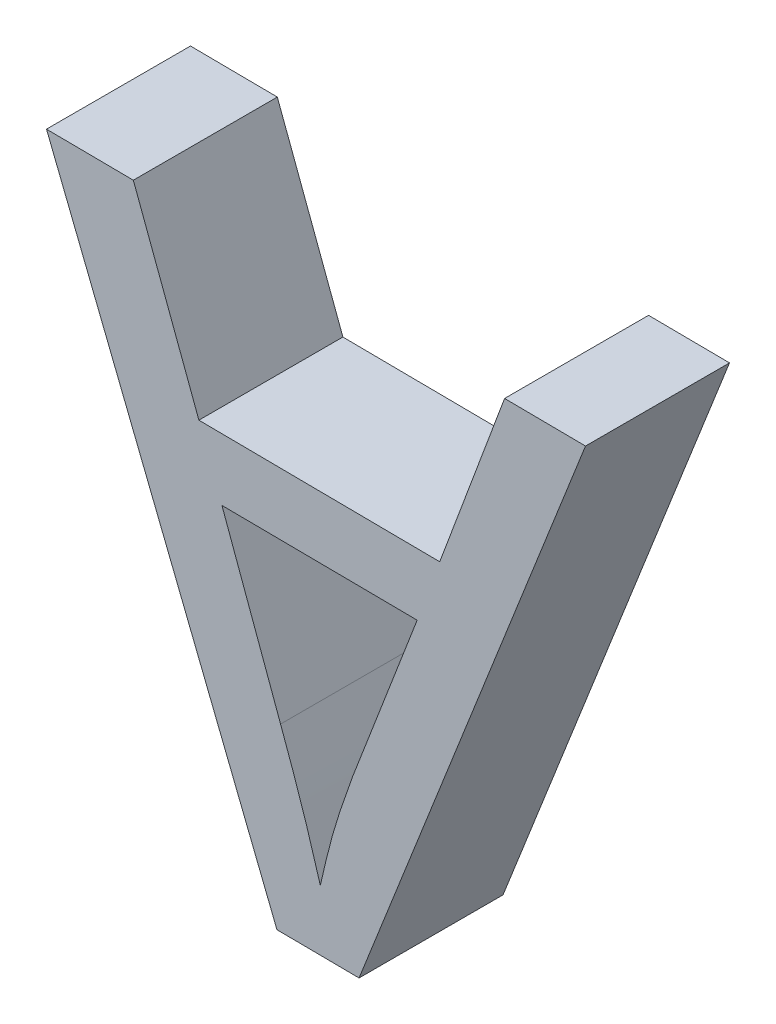
ISO-10303-21;
HEADER;
FILE_DESCRIPTION(('STEP AP214'),'2;1');
FILE_NAME('part.step','',(''),(''),'','','');
FILE_SCHEMA(('AUTOMOTIVE_DESIGN { 1 0 10303 214 1 1 1 1 }'));
ENDSEC;
DATA;
#1=APPLICATION_CONTEXT('core data for automotive mechanical design processes');
#2=APPLICATION_PROTOCOL_DEFINITION('international standard','automotive_design',2000,#1);
#3=PRODUCT_CONTEXT('',#1,'mechanical');
#4=PRODUCT('Part','Part','',(#3));
#5=PRODUCT_RELATED_PRODUCT_CATEGORY('part','',(#4));
#6=PRODUCT_DEFINITION_FORMATION('','',#4);
#7=PRODUCT_DEFINITION_CONTEXT('part definition',#1,'design');
#8=PRODUCT_DEFINITION('design','',#6,#7);
#9=PRODUCT_DEFINITION_SHAPE('','',#8);
#10=(LENGTH_UNIT() NAMED_UNIT(*) SI_UNIT(.MILLI.,.METRE.));
#11=(NAMED_UNIT(*) PLANE_ANGLE_UNIT() SI_UNIT($,.RADIAN.));
#12=(NAMED_UNIT(*) SI_UNIT($,.STERADIAN.) SOLID_ANGLE_UNIT());
#13=UNCERTAINTY_MEASURE_WITH_UNIT(LENGTH_MEASURE(1.E-05),#10,'distance_accuracy_value','');
#14=(GEOMETRIC_REPRESENTATION_CONTEXT(3) GLOBAL_UNCERTAINTY_ASSIGNED_CONTEXT((#13)) GLOBAL_UNIT_ASSIGNED_CONTEXT((#10,
#11,#12)) REPRESENTATION_CONTEXT('',''));
#15=CARTESIAN_POINT('',(0.,0.,0.));
#16=DIRECTION('',(0.,0.,1.));
#17=DIRECTION('',(1.,0.,0.));
#18=AXIS2_PLACEMENT_3D('',#15,#16,#17);
#19=CARTESIAN_POINT('',(-0.0146779465040658,8.14016208901112,0.));
#20=DIRECTION('',(0.936428455395928,0.350858586790743,0.));
#21=DIRECTION('',(0.,0.,-1.));
#22=AXIS2_PLACEMENT_3D('',#19,#20,#21);
#23=PLANE('',#22);
#24=DIRECTION('',(0.350858586790743,-0.936428455395928,0.));
#25=VECTOR('',#24,1.);
#26=CARTESIAN_POINT('',(-0.128549236752959,8.44408030693779,0.));
#27=LINE('',#26,#25);
#28=CARTESIAN_POINT('',(-0.128549236752959,8.44408030693779,0.));
#29=VERTEX_POINT('',#28);
#30=CARTESIAN_POINT('',(-0.0146779465040658,8.14016208901112,0.));
#31=VERTEX_POINT('',#30);
#32=EDGE_CURVE('E216',#29,#31,#27,.T.);
#33=ORIENTED_EDGE('',*,*,#32,.F.);
#34=DIRECTION('',(0.,0.,1.));
#35=VECTOR('',#34,1.);
#36=CARTESIAN_POINT('',(-0.128549236752959,8.44408030693779,0.));
#37=LINE('',#36,#35);
#38=CARTESIAN_POINT('',(-0.128549236752959,8.44408030693779,0.25));
#39=VERTEX_POINT('',#38);
#40=EDGE_CURVE('E277',#29,#39,#37,.T.);
#41=ORIENTED_EDGE('',*,*,#40,.T.);
#42=DIRECTION('',(-0.350858586790743,0.936428455395928,0.));
#43=VECTOR('',#42,1.);
#44=CARTESIAN_POINT('',(-0.128549236752959,8.44408030693779,0.25));
#45=LINE('',#44,#43);
#46=CARTESIAN_POINT('',(-0.0146779465040658,8.14016208901112,0.25));
#47=VERTEX_POINT('',#46);
#48=EDGE_CURVE('E232',#47,#39,#45,.T.);
#49=ORIENTED_EDGE('',*,*,#48,.F.);
#50=DIRECTION('',(0.,0.,1.));
#51=VECTOR('',#50,1.);
#52=CARTESIAN_POINT('',(-0.0146779465040658,8.14016208901112,0.));
#53=LINE('',#52,#51);
#54=EDGE_CURVE('E11',#31,#47,#53,.T.);
#55=ORIENTED_EDGE('',*,*,#54,.F.);
#56=EDGE_LOOP('',(#33,#41,#49,#55));
#57=FACE_BOUND('',#56,.T.);
#58=ADVANCED_FACE('F16',(#57),#23,.T.);
#59=CARTESIAN_POINT('',(0.403449057373279,8.13634085694236,0.));
#60=DIRECTION('',(0.00913854515184213,0.999958242624415,0.));
#61=DIRECTION('',(0.,0.,-1.));
#62=AXIS2_PLACEMENT_3D('',#59,#60,#61);
#63=PLANE('',#62);
#64=DIRECTION('',(0.999958242624415,-0.00913854515184213,0.));
#65=VECTOR('',#64,1.);
#66=CARTESIAN_POINT('',(-0.0146779465040658,8.14016208901112,0.));
#67=LINE('',#66,#65);
#68=CARTESIAN_POINT('',(0.403449057373279,8.13634085694236,0.));
#69=VERTEX_POINT('',#68);
#70=EDGE_CURVE('E219',#31,#69,#67,.T.);
#71=ORIENTED_EDGE('',*,*,#70,.F.);
#72=ORIENTED_EDGE('',*,*,#54,.T.);
#73=DIRECTION('',(-0.999958242624415,0.00913854515184213,0.));
#74=VECTOR('',#73,1.);
#75=CARTESIAN_POINT('',(-0.0146779465040658,8.14016208901112,0.25));
#76=LINE('',#75,#74);
#77=CARTESIAN_POINT('',(0.403449057373279,8.13634085694236,0.25));
#78=VERTEX_POINT('',#77);
#79=EDGE_CURVE('E224',#78,#47,#76,.T.);
#80=ORIENTED_EDGE('',*,*,#79,.F.);
#81=DIRECTION('',(0.,0.,1.));
#82=VECTOR('',#81,1.);
#83=CARTESIAN_POINT('',(0.403449057373279,8.13634085694236,0.));
#84=LINE('',#83,#82);
#85=EDGE_CURVE('E27',#69,#78,#84,.T.);
#86=ORIENTED_EDGE('',*,*,#85,.F.);
#87=EDGE_LOOP('',(#71,#72,#80,#86));
#88=FACE_BOUND('',#87,.T.);
#89=ADVANCED_FACE('F661',(#88),#63,.T.);
#90=CARTESIAN_POINT('',(0.12082792661046,7.44175949328272,0.));
#91=DIRECTION('',(-0.00913854515183979,-0.999958242624415,0.));
#92=DIRECTION('',(-0.999958242624415,0.00913854515183979,0.));
#93=AXIS2_PLACEMENT_3D('',#90,#91,#92);
#94=PLANE('',#93);
#95=DIRECTION('',(-0.999958242624415,0.00913854515183979,0.));
#96=VECTOR('',#95,1.);
#97=CARTESIAN_POINT('',(0.263386747039235,7.44045665866249,0.));
#98=LINE('',#97,#96);
#99=CARTESIAN_POINT('',(0.263386747039235,7.44045665866249,0.));
#100=VERTEX_POINT('',#99);
#101=CARTESIAN_POINT('',(0.12082792661046,7.44175949328272,0.));
#102=VERTEX_POINT('',#101);
#103=EDGE_CURVE('E243',#100,#102,#98,.T.);
#104=ORIENTED_EDGE('',*,*,#103,.F.);
#105=DIRECTION('',(0.,0.,1.));
#106=VECTOR('',#105,1.);
#107=CARTESIAN_POINT('',(0.263386747039235,7.44045665866249,0.));
#108=LINE('',#107,#106);
#109=CARTESIAN_POINT('',(0.263386747039235,7.44045665866249,0.25));
#110=VERTEX_POINT('',#109);
#111=EDGE_CURVE('E20',#100,#110,#108,.T.);
#112=ORIENTED_EDGE('',*,*,#111,.T.);
#113=DIRECTION('',(0.999958242624415,-0.00913854515183979,0.));
#114=VECTOR('',#113,1.);
#115=CARTESIAN_POINT('',(0.263386747039235,7.44045665866249,0.25));
#116=LINE('',#115,#114);
#117=CARTESIAN_POINT('',(0.12082792661046,7.44175949328272,0.25));
#118=VERTEX_POINT('',#117);
#119=EDGE_CURVE('E207',#118,#110,#116,.T.);
#120=ORIENTED_EDGE('',*,*,#119,.F.);
#121=DIRECTION('',(0.,0.,1.));
#122=VECTOR('',#121,1.);
#123=CARTESIAN_POINT('',(0.12082792661046,7.44175949328272,0.));
#124=LINE('',#123,#122);
#125=EDGE_CURVE('E306',#102,#118,#124,.T.);
#126=ORIENTED_EDGE('',*,*,#125,.F.);
#127=EDGE_LOOP('',(#104,#112,#120,#126));
#128=FACE_BOUND('',#127,.T.);
#129=ADVANCED_FACE('F343',(#128),#94,.T.);
#130=CARTESIAN_POINT('',(0.516034966202386,8.43818949911025,0.));
#131=DIRECTION('',(-0.936947503181286,0.349470136467129,0.));
#132=DIRECTION('',(0.,0.,1.));
#133=AXIS2_PLACEMENT_3D('',#130,#131,#132);
#134=PLANE('',#133);
#135=DIRECTION('',(0.349470136467129,0.936947503181286,0.));
#136=VECTOR('',#135,1.);
#137=CARTESIAN_POINT('',(0.403449057373279,8.13634085694236,0.));
#138=LINE('',#137,#136);
#139=CARTESIAN_POINT('',(0.516034966202386,8.43818949911025,0.));
#140=VERTEX_POINT('',#139);
#141=EDGE_CURVE('E251',#69,#140,#138,.T.);
#142=ORIENTED_EDGE('',*,*,#141,.F.);
#143=ORIENTED_EDGE('',*,*,#85,.T.);
#144=DIRECTION('',(-0.349470136467129,-0.936947503181286,0.));
#145=VECTOR('',#144,1.);
#146=CARTESIAN_POINT('',(0.403449057373279,8.13634085694236,0.25));
#147=LINE('',#146,#145);
#148=CARTESIAN_POINT('',(0.516034966202386,8.43818949911025,0.25));
#149=VERTEX_POINT('',#148);
#150=EDGE_CURVE('E221',#149,#78,#147,.T.);
#151=ORIENTED_EDGE('',*,*,#150,.F.);
#152=DIRECTION('',(0.,0.,1.));
#153=VECTOR('',#152,1.);
#154=CARTESIAN_POINT('',(0.516034966202386,8.43818949911025,0.));
#155=LINE('',#154,#153);
#156=EDGE_CURVE('E136',#140,#149,#155,.T.);
#157=ORIENTED_EDGE('',*,*,#156,.F.);
#158=EDGE_LOOP('',(#142,#143,#151,#157));
#159=FACE_BOUND('',#158,.T.);
#160=ADVANCED_FACE('F660',(#159),#134,.T.);
#161=CARTESIAN_POINT('',(0.0252629552289445,8.03201627227275,0.));
#162=DIRECTION('',(-0.00913854515184274,-0.999958242624415,0.));
#163=DIRECTION('',(-0.999958242624415,0.00913854515184274,0.));
#164=AXIS2_PLACEMENT_3D('',#161,#162,#163);
#165=PLANE('',#164);
#166=DIRECTION('',(-0.999958242624415,0.00913854515184274,0.));
#167=VECTOR('',#166,1.);
#168=CARTESIAN_POINT('',(0.364266607172335,8.02891814272306,0.));
#169=LINE('',#168,#167);
#170=CARTESIAN_POINT('',(0.364266607172335,8.02891814272306,0.));
#171=VERTEX_POINT('',#170);
#172=CARTESIAN_POINT('',(0.0252629552289445,8.03201627227275,0.));
#173=VERTEX_POINT('',#172);
#174=EDGE_CURVE('E247',#171,#173,#169,.T.);
#175=ORIENTED_EDGE('',*,*,#174,.F.);
#176=DIRECTION('',(0.,0.,1.));
#177=VECTOR('',#176,1.);
#178=CARTESIAN_POINT('',(0.364266607172335,8.02891814272306,0.));
#179=LINE('',#178,#177);
#180=CARTESIAN_POINT('',(0.364266607172335,8.02891814272306,0.25));
#181=VERTEX_POINT('',#180);
#182=EDGE_CURVE('E59',#171,#181,#179,.T.);
#183=ORIENTED_EDGE('',*,*,#182,.T.);
#184=DIRECTION('',(0.999958242624415,-0.00913854515184274,0.));
#185=VECTOR('',#184,1.);
#186=CARTESIAN_POINT('',(0.364266607172335,8.02891814272306,0.25));
#187=LINE('',#186,#185);
#188=CARTESIAN_POINT('',(0.0252629552289445,8.03201627227275,0.25));
#189=VERTEX_POINT('',#188);
#190=EDGE_CURVE('E177',#189,#181,#187,.T.);
#191=ORIENTED_EDGE('',*,*,#190,.F.);
#192=DIRECTION('',(0.,0.,1.));
#193=VECTOR('',#192,1.);
#194=CARTESIAN_POINT('',(0.0252629552289445,8.03201627227275,0.));
#195=LINE('',#194,#193);
#196=EDGE_CURVE('E172',#173,#189,#195,.T.);
#197=ORIENTED_EDGE('',*,*,#196,.F.);
#198=EDGE_LOOP('',(#175,#183,#191,#197));
#199=FACE_BOUND('',#198,.T.);
#200=ADVANCED_FACE('F328',(#199),#165,.T.);
#201=CARTESIAN_POINT('',(0.127093378407057,7.75413004530102,0.));
#202=DIRECTION('',(0.938943127184931,0.344072381792236,0.));
#203=DIRECTION('',(0.,0.,-1.));
#204=AXIS2_PLACEMENT_3D('',#201,#202,#203);
#205=PLANE('',#204);
#206=DIRECTION('',(0.344072381792236,-0.938943127184931,0.));
#207=VECTOR('',#206,1.);
#208=CARTESIAN_POINT('',(0.0252629552289446,8.03201627227275,0.));
#209=LINE('',#208,#207);
#210=CARTESIAN_POINT('',(0.127093378407057,7.75413004530102,0.));
#211=VERTEX_POINT('',#210);
#212=EDGE_CURVE('E206',#173,#211,#209,.T.);
#213=ORIENTED_EDGE('',*,*,#212,.F.);
#214=ORIENTED_EDGE('',*,*,#196,.T.);
#215=DIRECTION('',(-0.344072381792236,0.938943127184931,0.));
#216=VECTOR('',#215,1.);
#217=CARTESIAN_POINT('',(0.0252629552289446,8.03201627227275,0.25));
#218=LINE('',#217,#216);
#219=CARTESIAN_POINT('',(0.127093378407057,7.75413004530102,0.25));
#220=VERTEX_POINT('',#219);
#221=EDGE_CURVE('E170',#220,#189,#218,.T.);
#222=ORIENTED_EDGE('',*,*,#221,.F.);
#223=DIRECTION('',(0.,0.,1.));
#224=VECTOR('',#223,1.);
#225=CARTESIAN_POINT('',(0.127093378407057,7.75413004530102,0.));
#226=LINE('',#225,#224);
#227=EDGE_CURVE('E156',#211,#220,#226,.T.);
#228=ORIENTED_EDGE('',*,*,#227,.F.);
#229=EDGE_LOOP('',(#213,#214,#222,#228));
#230=FACE_BOUND('',#229,.T.);
#231=ADVANCED_FACE('F171',(#230),#205,.T.);
#232=CARTESIAN_POINT('',(0.263386747039235,7.44045665866249,0.));
#233=DIRECTION('',(0.930210818145052,-0.367025658239192,0.));
#234=DIRECTION('',(0.,0.,-1.));
#235=AXIS2_PLACEMENT_3D('',#232,#233,#234);
#236=PLANE('',#235);
#237=DIRECTION('',(-0.367025658239192,-0.930210818145052,0.));
#238=VECTOR('',#237,1.);
#239=CARTESIAN_POINT('',(0.656547346610332,8.4369053667555,0.));
#240=LINE('',#239,#238);
#241=CARTESIAN_POINT('',(0.656547346610332,8.4369053667555,0.));
#242=VERTEX_POINT('',#241);
#243=EDGE_CURVE('E240',#242,#100,#240,.T.);
#244=ORIENTED_EDGE('',*,*,#243,.F.);
#245=DIRECTION('',(0.,0.,1.));
#246=VECTOR('',#245,1.);
#247=CARTESIAN_POINT('',(0.656547346610332,8.4369053667555,0.));
#248=LINE('',#247,#246);
#249=CARTESIAN_POINT('',(0.656547346610332,8.4369053667555,0.25));
#250=VERTEX_POINT('',#249);
#251=EDGE_CURVE('E244',#242,#250,#248,.T.);
#252=ORIENTED_EDGE('',*,*,#251,.T.);
#253=DIRECTION('',(0.367025658239192,0.930210818145052,0.));
#254=VECTOR('',#253,1.);
#255=CARTESIAN_POINT('',(0.656547346610332,8.4369053667555,0.25));
#256=LINE('',#255,#254);
#257=EDGE_CURVE('E214',#110,#250,#256,.T.);
#258=ORIENTED_EDGE('',*,*,#257,.F.);
#259=ORIENTED_EDGE('',*,*,#111,.F.);
#260=EDGE_LOOP('',(#244,#252,#258,#259));
#261=FACE_BOUND('',#260,.T.);
#262=ADVANCED_FACE('F336',(#261),#236,.T.);
#263=CARTESIAN_POINT('',(-0.279293519254275,8.44545794789649,0.));
#264=DIRECTION('',(-0.928909421372805,-0.370307017061303,0.));
#265=DIRECTION('',(-0.370307017061303,0.928909421372805,0.));
#266=AXIS2_PLACEMENT_3D('',#263,#264,#265);
#267=PLANE('',#266);
#268=DIRECTION('',(-0.370307017061303,0.928909421372805,0.));
#269=VECTOR('',#268,1.);
#270=CARTESIAN_POINT('',(0.120827926610459,7.44175949328272,0.));
#271=LINE('',#270,#269);
#272=CARTESIAN_POINT('',(-0.279293519254275,8.44545794789649,0.));
#273=VERTEX_POINT('',#272);
#274=EDGE_CURVE('E267',#102,#273,#271,.T.);
#275=ORIENTED_EDGE('',*,*,#274,.F.);
#276=ORIENTED_EDGE('',*,*,#125,.T.);
#277=DIRECTION('',(0.370307017061303,-0.928909421372805,0.));
#278=VECTOR('',#277,1.);
#279=CARTESIAN_POINT('',(0.120827926610459,7.44175949328272,0.25));
#280=LINE('',#279,#278);
#281=CARTESIAN_POINT('',(-0.279293519254275,8.44545794789649,0.25));
#282=VERTEX_POINT('',#281);
#283=EDGE_CURVE('E215',#282,#118,#280,.T.);
#284=ORIENTED_EDGE('',*,*,#283,.F.);
#285=DIRECTION('',(0.,0.,1.));
#286=VECTOR('',#285,1.);
#287=CARTESIAN_POINT('',(-0.279293519254275,8.44545794789649,0.));
#288=LINE('',#287,#286);
#289=EDGE_CURVE('E274',#273,#282,#288,.T.);
#290=ORIENTED_EDGE('',*,*,#289,.F.);
#291=EDGE_LOOP('',(#275,#276,#284,#290));
#292=FACE_BOUND('',#291,.T.);
#293=ADVANCED_FACE('F348',(#292),#267,.T.);
#294=CARTESIAN_POINT('',(-0.128549236752959,8.44408030693779,0.));
#295=DIRECTION('',(0.00913854515184613,0.999958242624415,0.));
#296=DIRECTION('',(0.,0.,-1.));
#297=AXIS2_PLACEMENT_3D('',#294,#295,#296);
#298=PLANE('',#297);
#299=DIRECTION('',(0.999958242624415,-0.00913854515184613,0.));
#300=VECTOR('',#299,1.);
#301=CARTESIAN_POINT('',(-0.279293519254276,8.44545794789649,0.));
#302=LINE('',#301,#300);
#303=EDGE_CURVE('E220',#273,#29,#302,.T.);
#304=ORIENTED_EDGE('',*,*,#303,.F.);
#305=ORIENTED_EDGE('',*,*,#289,.T.);
#306=DIRECTION('',(-0.999958242624415,0.00913854515184613,0.));
#307=VECTOR('',#306,1.);
#308=CARTESIAN_POINT('',(-0.279293519254276,8.44545794789649,0.25));
#309=LINE('',#308,#307);
#310=EDGE_CURVE('E197',#39,#282,#309,.T.);
#311=ORIENTED_EDGE('',*,*,#310,.F.);
#312=ORIENTED_EDGE('',*,*,#40,.F.);
#313=EDGE_LOOP('',(#304,#305,#311,#312));
#314=FACE_BOUND('',#313,.T.);
#315=ADVANCED_FACE('F641',(#314),#298,.T.);
#316=CARTESIAN_POINT('',(0.364266607172335,8.02891814272306,0.));
#317=DIRECTION('',(-0.933264445247148,0.359190026639847,0.));
#318=DIRECTION('',(0.,0.,1.));
#319=AXIS2_PLACEMENT_3D('',#316,#317,#318);
#320=PLANE('',#319);
#321=DIRECTION('',(0.359190026639847,0.933264445247148,0.));
#322=VECTOR('',#321,1.);
#323=CARTESIAN_POINT('',(0.251767969454302,7.73661888346147,0.));
#324=LINE('',#323,#322);
#325=CARTESIAN_POINT('',(0.251767969454302,7.73661888346147,0.));
#326=VERTEX_POINT('',#325);
#327=EDGE_CURVE('E283',#326,#171,#324,.T.);
#328=ORIENTED_EDGE('',*,*,#327,.F.);
#329=DIRECTION('',(0.,0.,1.));
#330=VECTOR('',#329,1.);
#331=CARTESIAN_POINT('',(0.251767969454302,7.73661888346147,0.));
#332=LINE('',#331,#330);
#333=CARTESIAN_POINT('',(0.251767969454302,7.73661888346147,0.25));
#334=VERTEX_POINT('',#333);
#335=EDGE_CURVE('E74',#326,#334,#332,.T.);
#336=ORIENTED_EDGE('',*,*,#335,.T.);
#337=DIRECTION('',(-0.359190026639847,-0.933264445247148,0.));
#338=VECTOR('',#337,1.);
#339=CARTESIAN_POINT('',(0.251767969454302,7.73661888346147,0.25));
#340=LINE('',#339,#338);
#341=EDGE_CURVE('E191',#181,#334,#340,.T.);
#342=ORIENTED_EDGE('',*,*,#341,.F.);
#343=ORIENTED_EDGE('',*,*,#182,.F.);
#344=EDGE_LOOP('',(#328,#336,#342,#343));
#345=FACE_BOUND('',#344,.T.);
#346=ADVANCED_FACE('F325',(#345),#320,.T.);
#347=CARTESIAN_POINT('',(0.196136831434265,7.54612338491067,0.));
#348=CARTESIAN_POINT('',(0.196136831434265,7.54612338491067,0.25));
#349=CARTESIAN_POINT('',(0.186913463851153,7.57711045178989,0.));
#350=CARTESIAN_POINT('',(0.186913463851153,7.57711045178989,0.25));
#351=CARTESIAN_POINT('',(0.166063393095519,7.64715889463027,0.));
#352=CARTESIAN_POINT('',(0.166063393095519,7.64715889463027,0.25));
#353=CARTESIAN_POINT('',(0.141044665391837,7.71583431372302,0.));
#354=CARTESIAN_POINT('',(0.141044665391837,7.71583431372302,0.25));
#355=CARTESIAN_POINT('',(0.127093378407057,7.75413004530102,0.));
#356=CARTESIAN_POINT('',(0.127093378407057,7.75413004530102,0.25));
#357=(BOUNDED_SURFACE() B_SPLINE_SURFACE(3,1,((#347,#348),(#349,#350),(#351,#352),(#353,#354),
(#355,#356)),.UNSPECIFIED.,.F.,.F.,.F.) B_SPLINE_SURFACE_WITH_KNOTS((4,1,4),(2,2),
(-0.0219209434398483,-0.0122238579246973,0.),(0.,0.025),
.UNSPECIFIED.) GEOMETRIC_REPRESENTATION_ITEM() RATIONAL_B_SPLINE_SURFACE(((1.,1.),(1.,1.),(1.,
1.),(1.,1.),(1.,1.))) REPRESENTATION_ITEM('') SURFACE());
#358=CARTESIAN_POINT('',(0.127093378407057,7.75413004530102,0.));
#359=CARTESIAN_POINT('',(0.141044665391837,7.71583431372302,0.));
#360=CARTESIAN_POINT('',(0.166063393095519,7.64715889463027,0.));
#361=CARTESIAN_POINT('',(0.186913463851153,7.57711045178989,0.));
#362=CARTESIAN_POINT('',(0.196136831434265,7.54612338491067,0.));
#363=(BOUNDED_CURVE() B_SPLINE_CURVE(3,(#358,#359,#360,#361,#362),.UNSPECIFIED.,.F.,
.F.) B_SPLINE_CURVE_WITH_KNOTS((4,1,4),(0.,0.0122238579246973,0.0219209434398483),
.UNSPECIFIED.) CURVE() GEOMETRIC_REPRESENTATION_ITEM() RATIONAL_B_SPLINE_CURVE((1.,1.,1.,1.,1.)) REPRESENTATION_ITEM(''));
#364=CARTESIAN_POINT('',(0.196136831434265,7.54612338491067,0.));
#365=VERTEX_POINT('',#364);
#366=EDGE_CURVE('E163',#211,#365,#363,.T.);
#367=CARTESIAN_POINT('',(0.196136831434265,7.54612338491067,0.25));
#368=CARTESIAN_POINT('',(0.186913463851153,7.57711045178989,0.25));
#369=CARTESIAN_POINT('',(0.166063393095519,7.64715889463027,0.25));
#370=CARTESIAN_POINT('',(0.141044665391837,7.71583431372302,0.25));
#371=CARTESIAN_POINT('',(0.127093378407057,7.75413004530102,0.25));
#372=(BOUNDED_CURVE() B_SPLINE_CURVE(3,(#367,#368,#369,#370,#371),.UNSPECIFIED.,.F.,
.F.) B_SPLINE_CURVE_WITH_KNOTS((4,1,4),(-0.0219209434398483,-0.0122238579246973,0.),
.UNSPECIFIED.) CURVE() GEOMETRIC_REPRESENTATION_ITEM() RATIONAL_B_SPLINE_CURVE((1.,1.,1.,1.,1.)) REPRESENTATION_ITEM(''));
#373=CARTESIAN_POINT('',(0.196136831434265,7.54612338491067,0.25));
#374=VERTEX_POINT('',#373);
#375=EDGE_CURVE('E160',#374,#220,#372,.T.);
#376=DIRECTION('',(0.,0.,1.));
#377=VECTOR('',#376,1.);
#378=CARTESIAN_POINT('',(0.196136831434265,7.54612338491067,0.));
#379=LINE('',#378,#377);
#380=EDGE_CURVE('E41',#365,#374,#379,.T.);
#381=ORIENTED_EDGE('',*,*,#366,.F.);
#382=ORIENTED_EDGE('',*,*,#227,.T.);
#383=ORIENTED_EDGE('',*,*,#375,.F.);
#384=ORIENTED_EDGE('',*,*,#380,.F.);
#385=EDGE_LOOP('',(#381,#382,#383,#384));
#386=FACE_BOUND('',#385,.T.);
#387=ADVANCED_FACE('F158',(#386),#357,.T.);
#388=CARTESIAN_POINT('',(0.251767969454302,7.73661888346147,0.));
#389=CARTESIAN_POINT('',(0.251767969454302,7.73661888346147,0.25));
#390=CARTESIAN_POINT('',(0.240561738714224,7.70517848483268,0.));
#391=CARTESIAN_POINT('',(0.240561738714224,7.70517848483268,0.25));
#392=CARTESIAN_POINT('',(0.218314222150515,7.64276045994213,0.));
#393=CARTESIAN_POINT('',(0.218314222150515,7.64276045994213,0.25));
#394=CARTESIAN_POINT('',(0.203492665593489,7.57817613208273,0.));
#395=CARTESIAN_POINT('',(0.203492665593489,7.57817613208273,0.25));
#396=CARTESIAN_POINT('',(0.196136831434265,7.54612338491067,0.));
#397=CARTESIAN_POINT('',(0.196136831434265,7.54612338491067,0.25));
#398=(BOUNDED_SURFACE() B_SPLINE_SURFACE(3,1,((#388,#389),(#390,#391),(#392,#393),(#394,#395),
(#396,#397)),.UNSPECIFIED.,.F.,.F.,.F.) B_SPLINE_SURFACE_WITH_KNOTS((4,1,4),(2,2),
(-0.0198603104071659,-0.00985653221669089,0.),(0.,0.025),
.UNSPECIFIED.) GEOMETRIC_REPRESENTATION_ITEM() RATIONAL_B_SPLINE_SURFACE(((1.,1.),(1.,1.),(1.,
1.),(1.,1.),(1.,1.))) REPRESENTATION_ITEM('') SURFACE());
#399=CARTESIAN_POINT('',(0.196136831434265,7.54612338491067,0.));
#400=CARTESIAN_POINT('',(0.203492665593489,7.57817613208273,0.));
#401=CARTESIAN_POINT('',(0.218314222150515,7.64276045994213,0.));
#402=CARTESIAN_POINT('',(0.240561738714224,7.70517848483268,0.));
#403=CARTESIAN_POINT('',(0.251767969454302,7.73661888346147,0.));
#404=(BOUNDED_CURVE() B_SPLINE_CURVE(3,(#399,#400,#401,#402,#403),.UNSPECIFIED.,.F.,
.F.) B_SPLINE_CURVE_WITH_KNOTS((4,1,4),(0.,0.00985653221669089,0.0198603104071659),
.UNSPECIFIED.) CURVE() GEOMETRIC_REPRESENTATION_ITEM() RATIONAL_B_SPLINE_CURVE((1.,1.,1.,1.,1.)) REPRESENTATION_ITEM(''));
#405=EDGE_CURVE('E205',#365,#326,#404,.T.);
#406=CARTESIAN_POINT('',(0.251767969454302,7.73661888346147,0.25));
#407=CARTESIAN_POINT('',(0.240561738714224,7.70517848483268,0.25));
#408=CARTESIAN_POINT('',(0.218314222150515,7.64276045994213,0.25));
#409=CARTESIAN_POINT('',(0.203492665593489,7.57817613208273,0.25));
#410=CARTESIAN_POINT('',(0.196136831434265,7.54612338491067,0.25));
#411=(BOUNDED_CURVE() B_SPLINE_CURVE(3,(#406,#407,#408,#409,#410),.UNSPECIFIED.,.F.,
.F.) B_SPLINE_CURVE_WITH_KNOTS((4,1,4),(-0.0198603104071659,-0.00985653221669089,0.),
.UNSPECIFIED.) CURVE() GEOMETRIC_REPRESENTATION_ITEM() RATIONAL_B_SPLINE_CURVE((1.,1.,1.,1.,1.)) REPRESENTATION_ITEM(''));
#412=EDGE_CURVE('E182',#334,#374,#411,.T.);
#413=ORIENTED_EDGE('',*,*,#405,.F.);
#414=ORIENTED_EDGE('',*,*,#380,.T.);
#415=ORIENTED_EDGE('',*,*,#412,.F.);
#416=ORIENTED_EDGE('',*,*,#335,.F.);
#417=EDGE_LOOP('',(#413,#414,#415,#416));
#418=FACE_BOUND('',#417,.T.);
#419=ADVANCED_FACE('F326',(#418),#398,.T.);
#420=CARTESIAN_POINT('',(0.0434994918093967,7.94596675152105,0.));
#421=DIRECTION('',(0.,0.,1.));
#422=DIRECTION('',(1.,0.,0.));
#423=AXIS2_PLACEMENT_3D('',#420,#421,#422);
#424=PLANE('',#423);
#425=ORIENTED_EDGE('',*,*,#327,.T.);
#426=ORIENTED_EDGE('',*,*,#174,.T.);
#427=ORIENTED_EDGE('',*,*,#212,.T.);
#428=ORIENTED_EDGE('',*,*,#366,.T.);
#429=ORIENTED_EDGE('',*,*,#405,.T.);
#430=EDGE_LOOP('',(#425,#426,#427,#428,#429));
#431=FACE_BOUND('',#430,.T.);
#432=DIRECTION('',(0.999958242624415,-0.00913854515183915,0.));
#433=VECTOR('',#432,1.);
#434=CARTESIAN_POINT('',(0.516034966202386,8.43818949911025,0.));
#435=LINE('',#434,#433);
#436=EDGE_CURVE('E254',#140,#242,#435,.T.);
#437=ORIENTED_EDGE('',*,*,#436,.T.);
#438=ORIENTED_EDGE('',*,*,#243,.T.);
#439=ORIENTED_EDGE('',*,*,#103,.T.);
#440=ORIENTED_EDGE('',*,*,#274,.T.);
#441=ORIENTED_EDGE('',*,*,#303,.T.);
#442=ORIENTED_EDGE('',*,*,#32,.T.);
#443=ORIENTED_EDGE('',*,*,#70,.T.);
#444=ORIENTED_EDGE('',*,*,#141,.T.);
#445=EDGE_LOOP('',(#437,#438,#439,#440,#441,#442,#443,#444));
#446=FACE_BOUND('',#445,.T.);
#447=ADVANCED_FACE('F18',(#431,#446),#424,.F.);
#448=CARTESIAN_POINT('',(0.656547346610332,8.4369053667555,0.));
#449=DIRECTION('',(0.00913854515183915,0.999958242624415,0.));
#450=DIRECTION('',(0.,0.,-1.));
#451=AXIS2_PLACEMENT_3D('',#448,#449,#450);
#452=PLANE('',#451);
#453=ORIENTED_EDGE('',*,*,#436,.F.);
#454=ORIENTED_EDGE('',*,*,#156,.T.);
#455=DIRECTION('',(-0.999958242624415,0.00913854515183915,0.));
#456=VECTOR('',#455,1.);
#457=CARTESIAN_POINT('',(0.516034966202386,8.43818949911025,0.25));
#458=LINE('',#457,#456);
#459=EDGE_CURVE('E225',#250,#149,#458,.T.);
#460=ORIENTED_EDGE('',*,*,#459,.F.);
#461=ORIENTED_EDGE('',*,*,#251,.F.);
#462=EDGE_LOOP('',(#453,#454,#460,#461));
#463=FACE_BOUND('',#462,.T.);
#464=ADVANCED_FACE('F332',(#463),#452,.T.);
#465=CARTESIAN_POINT('',(0.0434994918093967,7.94596675152105,0.25));
#466=DIRECTION('',(0.,0.,1.));
#467=DIRECTION('',(1.,0.,0.));
#468=AXIS2_PLACEMENT_3D('',#465,#466,#467);
#469=PLANE('',#468);
#470=ORIENTED_EDGE('',*,*,#341,.T.);
#471=ORIENTED_EDGE('',*,*,#412,.T.);
#472=ORIENTED_EDGE('',*,*,#375,.T.);
#473=ORIENTED_EDGE('',*,*,#221,.T.);
#474=ORIENTED_EDGE('',*,*,#190,.T.);
#475=EDGE_LOOP('',(#470,#471,#472,#473,#474));
#476=FACE_BOUND('',#475,.T.);
#477=ORIENTED_EDGE('',*,*,#459,.T.);
#478=ORIENTED_EDGE('',*,*,#150,.T.);
#479=ORIENTED_EDGE('',*,*,#79,.T.);
#480=ORIENTED_EDGE('',*,*,#48,.T.);
#481=ORIENTED_EDGE('',*,*,#310,.T.);
#482=ORIENTED_EDGE('',*,*,#283,.T.);
#483=ORIENTED_EDGE('',*,*,#119,.T.);
#484=ORIENTED_EDGE('',*,*,#257,.T.);
#485=EDGE_LOOP('',(#477,#478,#479,#480,#481,#482,#483,#484));
#486=FACE_BOUND('',#485,.T.);
#487=ADVANCED_FACE('F180',(#476,#486),#469,.T.);
#488=CLOSED_SHELL('',(#58,#89,#129,#160,#200,#231,#262,#293,#315,#346,#387,#419,#447,#464,#487));
#489=MANIFOLD_SOLID_BREP('B1',#488);
#490=ADVANCED_BREP_SHAPE_REPRESENTATION('',(#18,#489),#14);
#491=SHAPE_DEFINITION_REPRESENTATION(#9,#490);
ENDSEC;
END-ISO-10303-21;
